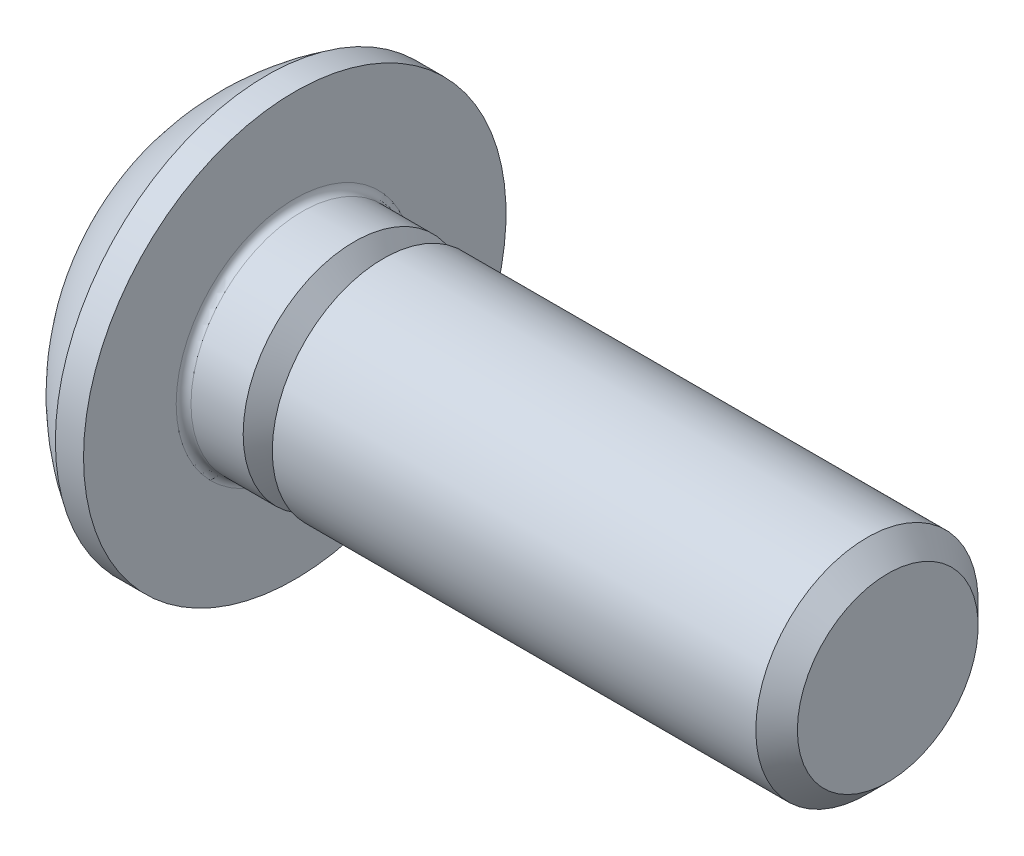
ISO-10303-21;
HEADER;
FILE_DESCRIPTION(('STEP AP214'),'2;1');
FILE_NAME('part.step','',(''),(''),'','','');
FILE_SCHEMA(('AUTOMOTIVE_DESIGN { 1 0 10303 214 1 1 1 1 }'));
ENDSEC;
DATA;
#1=APPLICATION_CONTEXT('core data for automotive mechanical design processes');
#2=APPLICATION_PROTOCOL_DEFINITION('international standard','automotive_design',2000,#1);
#3=PRODUCT_CONTEXT('',#1,'mechanical');
#4=PRODUCT('Part','Part','',(#3));
#5=PRODUCT_RELATED_PRODUCT_CATEGORY('part','',(#4));
#6=PRODUCT_DEFINITION_FORMATION('','',#4);
#7=PRODUCT_DEFINITION_CONTEXT('part definition',#1,'design');
#8=PRODUCT_DEFINITION('design','',#6,#7);
#9=PRODUCT_DEFINITION_SHAPE('','',#8);
#10=(LENGTH_UNIT() NAMED_UNIT(*) SI_UNIT(.MILLI.,.METRE.));
#11=(NAMED_UNIT(*) PLANE_ANGLE_UNIT() SI_UNIT($,.RADIAN.));
#12=(NAMED_UNIT(*) SI_UNIT($,.STERADIAN.) SOLID_ANGLE_UNIT());
#13=UNCERTAINTY_MEASURE_WITH_UNIT(LENGTH_MEASURE(1.E-05),#10,'distance_accuracy_value','');
#14=(GEOMETRIC_REPRESENTATION_CONTEXT(3) GLOBAL_UNCERTAINTY_ASSIGNED_CONTEXT((#13)) GLOBAL_UNIT_ASSIGNED_CONTEXT((#10,
#11,#12)) REPRESENTATION_CONTEXT('',''));
#15=CARTESIAN_POINT('',(0.,0.,0.));
#16=DIRECTION('',(0.,0.,1.));
#17=DIRECTION('',(1.,0.,0.));
#18=AXIS2_PLACEMENT_3D('',#15,#16,#17);
#19=CARTESIAN_POINT('',(0.,0.,0.));
#20=DIRECTION('',(-1.,0.,0.));
#21=DIRECTION('',(0.,0.,1.));
#22=AXIS2_PLACEMENT_3D('',#19,#20,#21);
#23=PLANE('',#22);
#24=CARTESIAN_POINT('',(0.,0.,0.));
#25=DIRECTION('',(-1.,0.,0.));
#26=DIRECTION('',(0.,0.,1.));
#27=AXIS2_PLACEMENT_3D('',#24,#25,#26);
#28=CIRCLE('',#27,1.425);
#29=CARTESIAN_POINT('',(0.,0.,1.425));
#30=VERTEX_POINT('',#29);
#31=EDGE_CURVE('E153',#30,#30,#28,.T.);
#32=ORIENTED_EDGE('',*,*,#31,.T.);
#33=EDGE_LOOP('',(#32));
#34=FACE_BOUND('',#33,.T.);
#35=DIRECTION('',(0.,-1.,0.));
#36=VECTOR('',#35,1.);
#37=CARTESIAN_POINT('',(0.,-0.577350269189625,0.999999999999998));
#38=LINE('',#37,#36);
#39=CARTESIAN_POINT('',(0.,0.577350269189628,1.));
#40=VERTEX_POINT('',#39);
#41=CARTESIAN_POINT('',(0.,-0.577350269189625,0.999999999999998));
#42=VERTEX_POINT('',#41);
#43=EDGE_CURVE('E48',#40,#42,#38,.T.);
#44=ORIENTED_EDGE('',*,*,#43,.T.);
#45=DIRECTION('',(0.,-0.499999999999999,-0.866025403784439));
#46=VECTOR('',#45,1.);
#47=CARTESIAN_POINT('',(0.,-1.15470053837925,0.));
#48=LINE('',#47,#46);
#49=CARTESIAN_POINT('',(0.,-1.15470053837925,0.));
#50=VERTEX_POINT('',#49);
#51=EDGE_CURVE('E244',#42,#50,#48,.T.);
#52=ORIENTED_EDGE('',*,*,#51,.T.);
#53=DIRECTION('',(0.,0.499999999999997,-0.86602540378444));
#54=VECTOR('',#53,1.);
#55=CARTESIAN_POINT('',(0.,-0.577350269189626,-1.));
#56=LINE('',#55,#54);
#57=CARTESIAN_POINT('',(0.,-0.577350269189626,-1.));
#58=VERTEX_POINT('',#57);
#59=EDGE_CURVE('E128',#50,#58,#56,.T.);
#60=ORIENTED_EDGE('',*,*,#59,.T.);
#61=DIRECTION('',(0.,1.,0.));
#62=VECTOR('',#61,1.);
#63=CARTESIAN_POINT('',(0.,0.577350269189628,-1.));
#64=LINE('',#63,#62);
#65=CARTESIAN_POINT('',(0.,0.577350269189628,-1.));
#66=VERTEX_POINT('',#65);
#67=EDGE_CURVE('E264',#58,#66,#64,.T.);
#68=ORIENTED_EDGE('',*,*,#67,.T.);
#69=DIRECTION('',(0.,0.499999999999998,0.866025403784439));
#70=VECTOR('',#69,1.);
#71=CARTESIAN_POINT('',(0.,1.15470053837925,0.));
#72=LINE('',#71,#70);
#73=CARTESIAN_POINT('',(0.,1.15470053837925,0.));
#74=VERTEX_POINT('',#73);
#75=EDGE_CURVE('E266',#66,#74,#72,.T.);
#76=ORIENTED_EDGE('',*,*,#75,.T.);
#77=DIRECTION('',(0.,-0.499999999999998,0.866025403784439));
#78=VECTOR('',#77,1.);
#79=CARTESIAN_POINT('',(0.,0.577350269189628,1.));
#80=LINE('',#79,#78);
#81=EDGE_CURVE('E268',#74,#40,#80,.T.);
#82=ORIENTED_EDGE('',*,*,#81,.T.);
#83=EDGE_LOOP('',(#44,#52,#60,#68,#76,#82));
#84=FACE_BOUND('',#83,.T.);
#85=ADVANCED_FACE('F33',(#34,#84),#23,.T.);
#86=CARTESIAN_POINT('',(3.03337598425198,0.,0.));
#87=DIRECTION('',(-1.,0.,0.));
#88=DIRECTION('',(0.,1.,0.));
#89=AXIS2_PLACEMENT_3D('',#86,#87,#88);
#90=SPHERICAL_SURFACE('',#89,3.35141684393879);
#91=CARTESIAN_POINT('',(1.27,0.,0.));
#92=DIRECTION('',(-1.,0.,0.));
#93=DIRECTION('',(0.,0.,1.));
#94=AXIS2_PLACEMENT_3D('',#91,#92,#93);
#95=CIRCLE('',#94,2.85);
#96=CARTESIAN_POINT('',(1.27,0.,2.85));
#97=VERTEX_POINT('',#96);
#98=EDGE_CURVE('E150',#97,#97,#95,.T.);
#99=ORIENTED_EDGE('',*,*,#98,.T.);
#100=EDGE_LOOP('',(#99));
#101=FACE_BOUND('',#100,.T.);
#102=ORIENTED_EDGE('',*,*,#31,.F.);
#103=EDGE_LOOP('',(#102));
#104=FACE_BOUND('',#103,.T.);
#105=ADVANCED_FACE('F174',(#101,#104),#90,.T.);
#106=CARTESIAN_POINT('',(0.,0.,0.));
#107=DIRECTION('',(-1.,0.,0.));
#108=DIRECTION('',(0.,0.,1.));
#109=AXIS2_PLACEMENT_3D('',#106,#107,#108);
#110=CYLINDRICAL_SURFACE('',#109,2.85);
#111=ORIENTED_EDGE('',*,*,#98,.F.);
#112=EDGE_LOOP('',(#111));
#113=FACE_BOUND('',#112,.T.);
#114=CARTESIAN_POINT('',(1.65,0.,0.));
#115=DIRECTION('',(-1.,0.,0.));
#116=DIRECTION('',(0.,0.,1.));
#117=AXIS2_PLACEMENT_3D('',#114,#115,#116);
#118=CIRCLE('',#117,2.85);
#119=CARTESIAN_POINT('',(1.65,0.,2.85));
#120=VERTEX_POINT('',#119);
#121=EDGE_CURVE('E147',#120,#120,#118,.T.);
#122=ORIENTED_EDGE('',*,*,#121,.T.);
#123=EDGE_LOOP('',(#122));
#124=FACE_BOUND('',#123,.T.);
#125=ADVANCED_FACE('F179',(#113,#124),#110,.T.);
#126=CARTESIAN_POINT('',(1.65,1.49999999999999,0.));
#127=DIRECTION('',(-1.,0.,0.));
#128=DIRECTION('',(0.,0.,1.));
#129=AXIS2_PLACEMENT_3D('',#126,#127,#128);
#130=PLANE('',#129);
#131=CARTESIAN_POINT('',(1.65,0.,0.));
#132=DIRECTION('',(-1.,0.,0.));
#133=DIRECTION('',(0.,0.,1.));
#134=AXIS2_PLACEMENT_3D('',#131,#132,#133);
#135=CIRCLE('',#134,1.6);
#136=CARTESIAN_POINT('',(1.65,0.,1.6));
#137=VERTEX_POINT('',#136);
#138=EDGE_CURVE('E41',#137,#137,#135,.T.);
#139=ORIENTED_EDGE('',*,*,#138,.T.);
#140=EDGE_LOOP('',(#139));
#141=FACE_BOUND('',#140,.T.);
#142=ORIENTED_EDGE('',*,*,#121,.F.);
#143=EDGE_LOOP('',(#142));
#144=FACE_BOUND('',#143,.T.);
#145=ADVANCED_FACE('F158',(#141,#144),#130,.F.);
#146=CARTESIAN_POINT('',(0.,0.,0.));
#147=DIRECTION('',(-1.,0.,0.));
#148=DIRECTION('',(0.,0.,1.));
#149=AXIS2_PLACEMENT_3D('',#146,#147,#148);
#150=CYLINDRICAL_SURFACE('',#149,1.5);
#151=CARTESIAN_POINT('',(2.45359178553218,0.,0.));
#152=DIRECTION('',(-1.,0.,0.));
#153=DIRECTION('',(0.,-1.,0.));
#154=AXIS2_PLACEMENT_3D('',#151,#152,#153);
#155=CIRCLE('',#154,1.5);
#156=CARTESIAN_POINT('',(2.45359178553218,-1.5,0.));
#157=VERTEX_POINT('',#156);
#158=EDGE_CURVE('E235',#157,#157,#155,.T.);
#159=ORIENTED_EDGE('',*,*,#158,.T.);
#160=EDGE_LOOP('',(#159));
#161=FACE_BOUND('',#160,.T.);
#162=CARTESIAN_POINT('',(1.75,0.,0.));
#163=DIRECTION('',(-1.,0.,0.));
#164=DIRECTION('',(0.,0.,1.));
#165=AXIS2_PLACEMENT_3D('',#162,#163,#164);
#166=CIRCLE('',#165,1.5);
#167=CARTESIAN_POINT('',(1.75,0.,1.5));
#168=VERTEX_POINT('',#167);
#169=EDGE_CURVE('E11',#168,#168,#166,.F.);
#170=ORIENTED_EDGE('',*,*,#169,.T.);
#171=EDGE_LOOP('',(#170));
#172=FACE_BOUND('',#171,.T.);
#173=ADVANCED_FACE('F162',(#161,#172),#150,.T.);
#174=CARTESIAN_POINT('',(1.75,0.,0.));
#175=DIRECTION('',(-1.,0.,0.));
#176=DIRECTION('',(0.,0.,1.));
#177=AXIS2_PLACEMENT_3D('',#174,#175,#176);
#178=TOROIDAL_SURFACE('',#177,1.6,0.1);
#179=ORIENTED_EDGE('',*,*,#169,.F.);
#180=EDGE_LOOP('',(#179));
#181=FACE_BOUND('',#180,.T.);
#182=ORIENTED_EDGE('',*,*,#138,.F.);
#183=EDGE_LOOP('',(#182));
#184=FACE_BOUND('',#183,.T.);
#185=ADVANCED_FACE('F35',(#181,#184),#178,.F.);
#186=CARTESIAN_POINT('',(1.04,-1.15470053837925,0.));
#187=DIRECTION('',(0.,0.866025403784439,-0.499999999999999));
#188=DIRECTION('',(0.,0.499999999999999,0.866025403784439));
#189=AXIS2_PLACEMENT_3D('',#186,#187,#188);
#190=PLANE('',#189);
#191=DIRECTION('',(0.,-0.499999999999999,-0.866025403784439));
#192=VECTOR('',#191,1.);
#193=CARTESIAN_POINT('',(1.04,-1.15470053837925,0.));
#194=LINE('',#193,#192);
#195=CARTESIAN_POINT('',(1.04,-0.577350269189625,0.999999999999998));
#196=VERTEX_POINT('',#195);
#197=CARTESIAN_POINT('',(1.04,-0.866025403784437,0.499999999999998));
#198=VERTEX_POINT('',#197);
#199=EDGE_CURVE('E114',#196,#198,#194,.T.);
#200=ORIENTED_EDGE('',*,*,#199,.T.);
#201=CARTESIAN_POINT('',(1.04,-1.15470053837925,0.));
#202=VERTEX_POINT('',#201);
#203=EDGE_CURVE('E109',#198,#202,#194,.T.);
#204=ORIENTED_EDGE('',*,*,#203,.T.);
#205=DIRECTION('',(-1.,0.,0.));
#206=VECTOR('',#205,1.);
#207=CARTESIAN_POINT('',(1.04,-1.15470053837925,0.));
#208=LINE('',#207,#206);
#209=EDGE_CURVE('E111',#202,#50,#208,.T.);
#210=ORIENTED_EDGE('',*,*,#209,.T.);
#211=ORIENTED_EDGE('',*,*,#51,.F.);
#212=DIRECTION('',(-1.,0.,0.));
#213=VECTOR('',#212,1.);
#214=CARTESIAN_POINT('',(1.04,-0.577350269189625,0.999999999999998));
#215=LINE('',#214,#213);
#216=EDGE_CURVE('E261',#196,#42,#215,.T.);
#217=ORIENTED_EDGE('',*,*,#216,.F.);
#218=EDGE_LOOP('',(#200,#204,#210,#211,#217));
#219=FACE_BOUND('',#218,.T.);
#220=ADVANCED_FACE('F110',(#219),#190,.T.);
#221=CARTESIAN_POINT('',(1.04,-0.577350269189626,-1.));
#222=DIRECTION('',(0.,0.86602540378444,0.499999999999998));
#223=DIRECTION('',(0.,-0.499999999999998,0.86602540378444));
#224=AXIS2_PLACEMENT_3D('',#221,#222,#223);
#225=PLANE('',#224);
#226=DIRECTION('',(0.,0.499999999999997,-0.86602540378444));
#227=VECTOR('',#226,1.);
#228=CARTESIAN_POINT('',(1.04,-0.577350269189626,-1.));
#229=LINE('',#228,#227);
#230=CARTESIAN_POINT('',(1.04,-0.86602540378444,-0.499999999999997));
#231=VERTEX_POINT('',#230);
#232=EDGE_CURVE('E56',#202,#231,#229,.T.);
#233=ORIENTED_EDGE('',*,*,#232,.T.);
#234=CARTESIAN_POINT('',(1.04,-0.577350269189626,-1.));
#235=VERTEX_POINT('',#234);
#236=EDGE_CURVE('E123',#231,#235,#229,.T.);
#237=ORIENTED_EDGE('',*,*,#236,.T.);
#238=DIRECTION('',(-1.,0.,0.));
#239=VECTOR('',#238,1.);
#240=CARTESIAN_POINT('',(1.04,-0.577350269189626,-1.));
#241=LINE('',#240,#239);
#242=EDGE_CURVE('E130',#235,#58,#241,.T.);
#243=ORIENTED_EDGE('',*,*,#242,.T.);
#244=ORIENTED_EDGE('',*,*,#59,.F.);
#245=ORIENTED_EDGE('',*,*,#209,.F.);
#246=EDGE_LOOP('',(#233,#237,#243,#244,#245));
#247=FACE_BOUND('',#246,.T.);
#248=ADVANCED_FACE('F126',(#247),#225,.T.);
#249=CARTESIAN_POINT('',(1.04,0.577350269189628,-1.));
#250=DIRECTION('',(0.,0.,1.));
#251=DIRECTION('',(0.,-1.,0.));
#252=AXIS2_PLACEMENT_3D('',#249,#250,#251);
#253=PLANE('',#252);
#254=DIRECTION('',(0.,1.,0.));
#255=VECTOR('',#254,1.);
#256=CARTESIAN_POINT('',(1.04,0.577350269189628,-1.));
#257=LINE('',#256,#255);
#258=CARTESIAN_POINT('',(1.04,0.,-1.));
#259=VERTEX_POINT('',#258);
#260=EDGE_CURVE('E246',#235,#259,#257,.T.);
#261=ORIENTED_EDGE('',*,*,#260,.T.);
#262=CARTESIAN_POINT('',(1.04,0.577350269189628,-1.));
#263=VERTEX_POINT('',#262);
#264=EDGE_CURVE('E122',#259,#263,#257,.T.);
#265=ORIENTED_EDGE('',*,*,#264,.T.);
#266=DIRECTION('',(-1.,0.,0.));
#267=VECTOR('',#266,1.);
#268=CARTESIAN_POINT('',(1.04,0.577350269189628,-1.));
#269=LINE('',#268,#267);
#270=EDGE_CURVE('E135',#263,#66,#269,.T.);
#271=ORIENTED_EDGE('',*,*,#270,.T.);
#272=ORIENTED_EDGE('',*,*,#67,.F.);
#273=ORIENTED_EDGE('',*,*,#242,.F.);
#274=EDGE_LOOP('',(#261,#265,#271,#272,#273));
#275=FACE_BOUND('',#274,.T.);
#276=ADVANCED_FACE('F205',(#275),#253,.T.);
#277=CARTESIAN_POINT('',(1.04,1.15470053837925,0.));
#278=DIRECTION('',(0.,-0.86602540378444,0.499999999999998));
#279=DIRECTION('',(0.,-0.499999999999998,-0.86602540378444));
#280=AXIS2_PLACEMENT_3D('',#277,#278,#279);
#281=PLANE('',#280);
#282=DIRECTION('',(0.,0.499999999999998,0.866025403784439));
#283=VECTOR('',#282,1.);
#284=CARTESIAN_POINT('',(1.04,1.15470053837925,0.));
#285=LINE('',#284,#283);
#286=CARTESIAN_POINT('',(1.04,0.86602540378444,-0.499999999999999));
#287=VERTEX_POINT('',#286);
#288=EDGE_CURVE('E250',#263,#287,#285,.T.);
#289=ORIENTED_EDGE('',*,*,#288,.T.);
#290=CARTESIAN_POINT('',(1.04,1.15470053837925,0.));
#291=VERTEX_POINT('',#290);
#292=EDGE_CURVE('E249',#287,#291,#285,.T.);
#293=ORIENTED_EDGE('',*,*,#292,.T.);
#294=DIRECTION('',(-1.,0.,0.));
#295=VECTOR('',#294,1.);
#296=CARTESIAN_POINT('',(1.04,1.15470053837925,0.));
#297=LINE('',#296,#295);
#298=EDGE_CURVE('E276',#291,#74,#297,.T.);
#299=ORIENTED_EDGE('',*,*,#298,.T.);
#300=ORIENTED_EDGE('',*,*,#75,.F.);
#301=ORIENTED_EDGE('',*,*,#270,.F.);
#302=EDGE_LOOP('',(#289,#293,#299,#300,#301));
#303=FACE_BOUND('',#302,.T.);
#304=ADVANCED_FACE('F208',(#303),#281,.T.);
#305=CARTESIAN_POINT('',(1.04,0.577350269189628,1.));
#306=DIRECTION('',(0.,-0.86602540378444,-0.499999999999998));
#307=DIRECTION('',(0.,0.499999999999998,-0.86602540378444));
#308=AXIS2_PLACEMENT_3D('',#305,#306,#307);
#309=PLANE('',#308);
#310=DIRECTION('',(0.,-0.499999999999998,0.866025403784439));
#311=VECTOR('',#310,1.);
#312=CARTESIAN_POINT('',(1.04,0.577350269189628,1.));
#313=LINE('',#312,#311);
#314=CARTESIAN_POINT('',(1.04,0.86602540378444,0.499999999999999));
#315=VERTEX_POINT('',#314);
#316=EDGE_CURVE('E254',#291,#315,#313,.T.);
#317=ORIENTED_EDGE('',*,*,#316,.T.);
#318=CARTESIAN_POINT('',(1.04,0.577350269189628,1.));
#319=VERTEX_POINT('',#318);
#320=EDGE_CURVE('E253',#315,#319,#313,.T.);
#321=ORIENTED_EDGE('',*,*,#320,.T.);
#322=DIRECTION('',(-1.,0.,0.));
#323=VECTOR('',#322,1.);
#324=CARTESIAN_POINT('',(1.04,0.577350269189628,1.));
#325=LINE('',#324,#323);
#326=EDGE_CURVE('E273',#319,#40,#325,.T.);
#327=ORIENTED_EDGE('',*,*,#326,.T.);
#328=ORIENTED_EDGE('',*,*,#81,.F.);
#329=ORIENTED_EDGE('',*,*,#298,.F.);
#330=EDGE_LOOP('',(#317,#321,#327,#328,#329));
#331=FACE_BOUND('',#330,.T.);
#332=ADVANCED_FACE('F212',(#331),#309,.T.);
#333=CARTESIAN_POINT('',(1.04,-0.577350269189625,0.999999999999998));
#334=DIRECTION('',(0.,0.,-1.));
#335=DIRECTION('',(0.,1.,0.));
#336=AXIS2_PLACEMENT_3D('',#333,#334,#335);
#337=PLANE('',#336);
#338=DIRECTION('',(0.,-1.,0.));
#339=VECTOR('',#338,1.);
#340=CARTESIAN_POINT('',(1.04,-0.577350269189625,0.999999999999998));
#341=LINE('',#340,#339);
#342=CARTESIAN_POINT('',(1.04,0.,1.));
#343=VERTEX_POINT('',#342);
#344=EDGE_CURVE('E258',#319,#343,#341,.T.);
#345=ORIENTED_EDGE('',*,*,#344,.T.);
#346=EDGE_CURVE('E257',#343,#196,#341,.T.);
#347=ORIENTED_EDGE('',*,*,#346,.T.);
#348=ORIENTED_EDGE('',*,*,#216,.T.);
#349=ORIENTED_EDGE('',*,*,#43,.F.);
#350=ORIENTED_EDGE('',*,*,#326,.F.);
#351=EDGE_LOOP('',(#345,#347,#348,#349,#350));
#352=FACE_BOUND('',#351,.T.);
#353=ADVANCED_FACE('F216',(#352),#337,.T.);
#354=CARTESIAN_POINT('',(1.04,-1.73205080756887,-0.999999999999999));
#355=DIRECTION('',(1.,0.,0.));
#356=DIRECTION('',(0.,0.,-1.));
#357=AXIS2_PLACEMENT_3D('',#354,#355,#356);
#358=PLANE('',#357);
#359=CARTESIAN_POINT('',(1.04,0.,0.));
#360=DIRECTION('',(-1.,0.,0.));
#361=DIRECTION('',(0.,0.,1.));
#362=AXIS2_PLACEMENT_3D('',#359,#360,#361);
#363=CIRCLE('',#362,1.);
#364=EDGE_CURVE('E290',#287,#259,#363,.T.);
#365=ORIENTED_EDGE('',*,*,#364,.F.);
#366=ORIENTED_EDGE('',*,*,#288,.F.);
#367=ORIENTED_EDGE('',*,*,#264,.F.);
#368=EDGE_LOOP('',(#365,#366,#367));
#369=FACE_BOUND('',#368,.T.);
#370=ADVANCED_FACE('F220',(#369),#358,.F.);
#371=EDGE_CURVE('E141',#315,#287,#363,.T.);
#372=ORIENTED_EDGE('',*,*,#371,.F.);
#373=ORIENTED_EDGE('',*,*,#316,.F.);
#374=ORIENTED_EDGE('',*,*,#292,.F.);
#375=EDGE_LOOP('',(#372,#373,#374));
#376=FACE_BOUND('',#375,.T.);
#377=ADVANCED_FACE('F298',(#376),#358,.F.);
#378=EDGE_CURVE('E134',#343,#315,#363,.T.);
#379=ORIENTED_EDGE('',*,*,#378,.F.);
#380=ORIENTED_EDGE('',*,*,#344,.F.);
#381=ORIENTED_EDGE('',*,*,#320,.F.);
#382=EDGE_LOOP('',(#379,#380,#381));
#383=FACE_BOUND('',#382,.T.);
#384=ADVANCED_FACE('F301',(#383),#358,.F.);
#385=EDGE_CURVE('E129',#198,#343,#363,.T.);
#386=ORIENTED_EDGE('',*,*,#385,.F.);
#387=ORIENTED_EDGE('',*,*,#199,.F.);
#388=ORIENTED_EDGE('',*,*,#346,.F.);
#389=EDGE_LOOP('',(#386,#387,#388));
#390=FACE_BOUND('',#389,.T.);
#391=ADVANCED_FACE('F305',(#390),#358,.F.);
#392=EDGE_CURVE('E120',#231,#198,#363,.T.);
#393=ORIENTED_EDGE('',*,*,#392,.F.);
#394=ORIENTED_EDGE('',*,*,#232,.F.);
#395=ORIENTED_EDGE('',*,*,#203,.F.);
#396=EDGE_LOOP('',(#393,#394,#395));
#397=FACE_BOUND('',#396,.T.);
#398=ADVANCED_FACE('F119',(#397),#358,.F.);
#399=EDGE_CURVE('E289',#259,#231,#363,.T.);
#400=ORIENTED_EDGE('',*,*,#399,.F.);
#401=ORIENTED_EDGE('',*,*,#260,.F.);
#402=ORIENTED_EDGE('',*,*,#236,.F.);
#403=EDGE_LOOP('',(#400,#401,#402));
#404=FACE_BOUND('',#403,.T.);
#405=ADVANCED_FACE('F200',(#404),#358,.F.);
#406=CARTESIAN_POINT('',(1.61735026918963,0.,0.));
#407=DIRECTION('',(-1.,0.,0.));
#408=DIRECTION('',(0.,0.,1.));
#409=AXIS2_PLACEMENT_3D('',#406,#407,#408);
#410=CONICAL_SURFACE('',#409,0.,1.04719755119659);
#411=ORIENTED_EDGE('',*,*,#378,.T.);
#412=ORIENTED_EDGE('',*,*,#371,.T.);
#413=ORIENTED_EDGE('',*,*,#364,.T.);
#414=ORIENTED_EDGE('',*,*,#399,.T.);
#415=ORIENTED_EDGE('',*,*,#392,.T.);
#416=ORIENTED_EDGE('',*,*,#385,.T.);
#417=EDGE_LOOP('',(#411,#412,#413,#414,#415,#416));
#418=FACE_BOUND('',#417,.T.);
#419=CARTESIAN_POINT('',(1.61735026918963,0.,0.));
#420=VERTEX_POINT('',#419);
#421=VERTEX_LOOP('',#420);
#422=FACE_BOUND('',#421,.T.);
#423=ADVANCED_FACE('F197',(#418,#422),#410,.F.);
#424=CARTESIAN_POINT('',(2.84640821446783,0.,0.));
#425=DIRECTION('',(1.,0.,0.));
#426=DIRECTION('',(0.,1.,0.));
#427=AXIS2_PLACEMENT_3D('',#424,#425,#426);
#428=CONICAL_SURFACE('',#427,1.5,0.959931088596875);
#429=CARTESIAN_POINT('',(2.65,0.,0.));
#430=DIRECTION('',(-1.,0.,0.));
#431=DIRECTION('',(0.,-1.,0.));
#432=AXIS2_PLACEMENT_3D('',#429,#430,#431);
#433=CIRCLE('',#432,1.2195);
#434=CARTESIAN_POINT('',(2.65,-1.2195,0.));
#435=VERTEX_POINT('',#434);
#436=EDGE_CURVE('E238',#435,#435,#433,.T.);
#437=ORIENTED_EDGE('',*,*,#436,.F.);
#438=EDGE_LOOP('',(#437));
#439=FACE_BOUND('',#438,.T.);
#440=CARTESIAN_POINT('',(2.84640821446783,0.,0.));
#441=DIRECTION('',(-1.,0.,0.));
#442=DIRECTION('',(0.,-1.,0.));
#443=AXIS2_PLACEMENT_3D('',#440,#441,#442);
#444=CIRCLE('',#443,1.5);
#445=CARTESIAN_POINT('',(2.84640821446783,-1.5,0.));
#446=VERTEX_POINT('',#445);
#447=EDGE_CURVE('E240',#446,#446,#444,.T.);
#448=ORIENTED_EDGE('',*,*,#447,.T.);
#449=EDGE_LOOP('',(#448));
#450=FACE_BOUND('',#449,.T.);
#451=ADVANCED_FACE('F199',(#439,#450),#428,.T.);
#452=CARTESIAN_POINT('',(2.65,0.,0.));
#453=DIRECTION('',(-1.,0.,0.));
#454=DIRECTION('',(0.,-1.,0.));
#455=AXIS2_PLACEMENT_3D('',#452,#453,#454);
#456=CONICAL_SURFACE('',#455,1.2195,0.959931088596875);
#457=ORIENTED_EDGE('',*,*,#158,.F.);
#458=EDGE_LOOP('',(#457));
#459=FACE_BOUND('',#458,.T.);
#460=ORIENTED_EDGE('',*,*,#436,.T.);
#461=EDGE_LOOP('',(#460));
#462=FACE_BOUND('',#461,.T.);
#463=ADVANCED_FACE('F195',(#459,#462),#456,.T.);
#464=CARTESIAN_POINT('',(9.65,0.,0.));
#465=DIRECTION('',(-1.,0.,0.));
#466=DIRECTION('',(0.,0.,1.));
#467=AXIS2_PLACEMENT_3D('',#464,#465,#466);
#468=PLANE('',#467);
#469=CARTESIAN_POINT('',(9.65,0.,0.));
#470=DIRECTION('',(-1.,0.,0.));
#471=DIRECTION('',(0.,0.,1.));
#472=AXIS2_PLACEMENT_3D('',#469,#470,#471);
#473=CIRCLE('',#472,1.2195);
#474=CARTESIAN_POINT('',(9.65,0.,1.2195));
#475=VERTEX_POINT('',#474);
#476=EDGE_CURVE('E140',#475,#475,#473,.T.);
#477=ORIENTED_EDGE('',*,*,#476,.F.);
#478=EDGE_LOOP('',(#477));
#479=FACE_BOUND('',#478,.T.);
#480=ADVANCED_FACE('F191',(#479),#468,.F.);
#481=CARTESIAN_POINT('',(9.65,0.,0.));
#482=DIRECTION('',(-1.,0.,0.));
#483=DIRECTION('',(0.,0.,1.));
#484=AXIS2_PLACEMENT_3D('',#481,#482,#483);
#485=CONICAL_SURFACE('',#484,1.2195,0.785398163397452);
#486=CARTESIAN_POINT('',(9.3695,0.,0.));
#487=DIRECTION('',(-1.,0.,0.));
#488=DIRECTION('',(0.,0.,1.));
#489=AXIS2_PLACEMENT_3D('',#486,#487,#488);
#490=CIRCLE('',#489,1.5);
#491=CARTESIAN_POINT('',(9.3695,0.,1.5));
#492=VERTEX_POINT('',#491);
#493=EDGE_CURVE('E144',#492,#492,#490,.T.);
#494=ORIENTED_EDGE('',*,*,#493,.F.);
#495=EDGE_LOOP('',(#494));
#496=FACE_BOUND('',#495,.T.);
#497=ORIENTED_EDGE('',*,*,#476,.T.);
#498=EDGE_LOOP('',(#497));
#499=FACE_BOUND('',#498,.T.);
#500=ADVANCED_FACE('F188',(#496,#499),#485,.T.);
#501=ORIENTED_EDGE('',*,*,#447,.F.);
#502=EDGE_LOOP('',(#501));
#503=FACE_BOUND('',#502,.T.);
#504=ORIENTED_EDGE('',*,*,#493,.T.);
#505=EDGE_LOOP('',(#504));
#506=FACE_BOUND('',#505,.T.);
#507=ADVANCED_FACE('F171',(#503,#506),#150,.T.);
#508=CLOSED_SHELL('',(#85,#105,#125,#145,#173,#185,#220,#248,#276,#304,#332,#353,#370,#377,#384,
#391,#398,#405,#423,#451,#463,#480,#500,#507));
#509=MANIFOLD_SOLID_BREP('B2',#508);
#510=ADVANCED_BREP_SHAPE_REPRESENTATION('',(#18,#509),#14);
#511=SHAPE_DEFINITION_REPRESENTATION(#9,#510);
ENDSEC;
END-ISO-10303-21;
